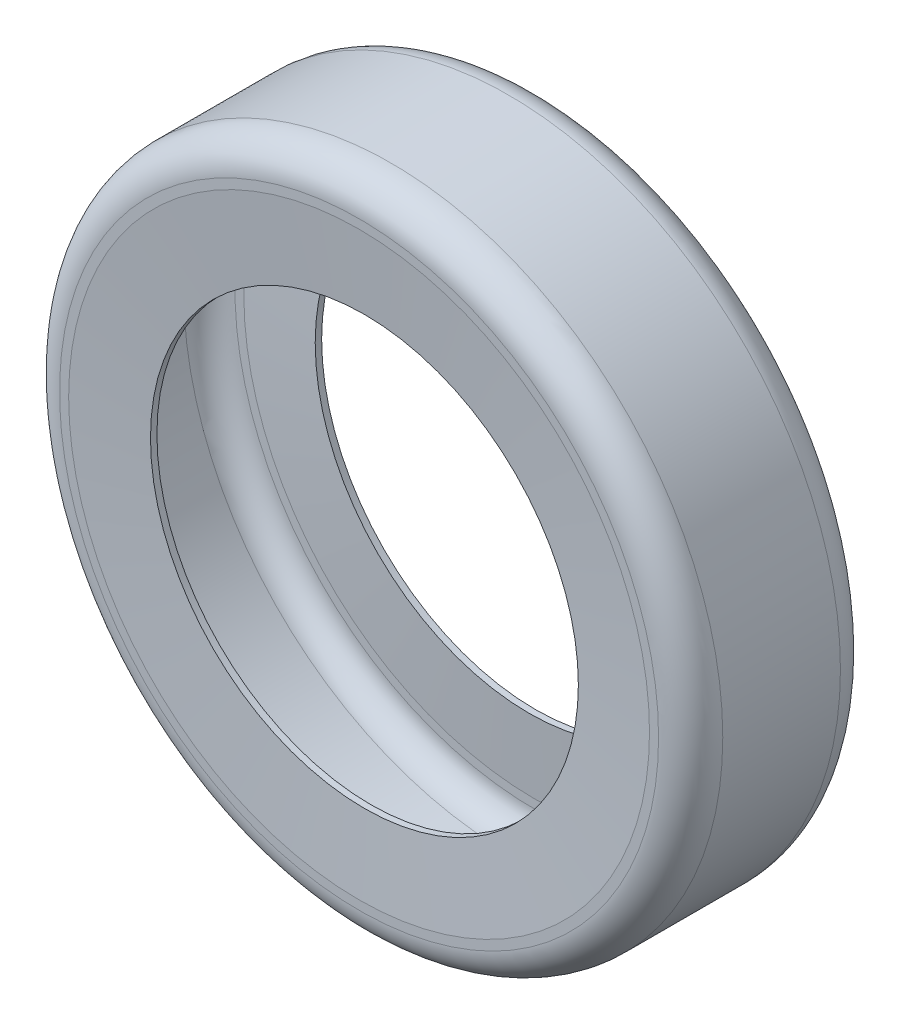
ISO-10303-21;
HEADER;
FILE_DESCRIPTION(('STEP AP214'),'2;1');
FILE_NAME('part.step','',(''),(''),'','','');
FILE_SCHEMA(('AUTOMOTIVE_DESIGN { 1 0 10303 214 1 1 1 1 }'));
ENDSEC;
DATA;
#1=APPLICATION_CONTEXT('core data for automotive mechanical design processes');
#2=APPLICATION_PROTOCOL_DEFINITION('international standard','automotive_design',2000,#1);
#3=PRODUCT_CONTEXT('',#1,'mechanical');
#4=PRODUCT('Part','Part','',(#3));
#5=PRODUCT_RELATED_PRODUCT_CATEGORY('part','',(#4));
#6=PRODUCT_DEFINITION_FORMATION('','',#4);
#7=PRODUCT_DEFINITION_CONTEXT('part definition',#1,'design');
#8=PRODUCT_DEFINITION('design','',#6,#7);
#9=PRODUCT_DEFINITION_SHAPE('','',#8);
#10=(LENGTH_UNIT() NAMED_UNIT(*) SI_UNIT(.MILLI.,.METRE.));
#11=(NAMED_UNIT(*) PLANE_ANGLE_UNIT() SI_UNIT($,.RADIAN.));
#12=(NAMED_UNIT(*) SI_UNIT($,.STERADIAN.) SOLID_ANGLE_UNIT());
#13=UNCERTAINTY_MEASURE_WITH_UNIT(LENGTH_MEASURE(1.E-05),#10,'distance_accuracy_value','');
#14=(GEOMETRIC_REPRESENTATION_CONTEXT(3) GLOBAL_UNCERTAINTY_ASSIGNED_CONTEXT((#13)) GLOBAL_UNIT_ASSIGNED_CONTEXT((#10,
#11,#12)) REPRESENTATION_CONTEXT('',''));
#15=CARTESIAN_POINT('',(0.,0.,0.));
#16=DIRECTION('',(0.,0.,1.));
#17=DIRECTION('',(1.,0.,0.));
#18=AXIS2_PLACEMENT_3D('',#15,#16,#17);
#19=CARTESIAN_POINT('',(0.,0.,85.));
#20=DIRECTION('',(0.,0.,-1.));
#21=DIRECTION('',(-1.,0.,0.));
#22=AXIS2_PLACEMENT_3D('',#19,#20,#21);
#23=CYLINDRICAL_SURFACE('',#22,100.);
#24=CARTESIAN_POINT('',(0.,0.,5.50732569424352));
#25=DIRECTION('',(0.,0.,-1.));
#26=DIRECTION('',(-1.,0.,0.));
#27=AXIS2_PLACEMENT_3D('',#24,#25,#26);
#28=CIRCLE('',#27,100.);
#29=CARTESIAN_POINT('',(-100.,0.,5.50732569424352));
#30=VERTEX_POINT('',#29);
#31=EDGE_CURVE('E75',#30,#30,#28,.T.);
#32=ORIENTED_EDGE('',*,*,#31,.F.);
#33=EDGE_LOOP('',(#32));
#34=FACE_BOUND('',#33,.T.);
#35=CARTESIAN_POINT('',(0.,0.,2.5));
#36=DIRECTION('',(0.,0.,1.));
#37=DIRECTION('',(1.,0.,0.));
#38=AXIS2_PLACEMENT_3D('',#35,#36,#37);
#39=CIRCLE('',#38,100.);
#40=CARTESIAN_POINT('',(100.,0.,2.5));
#41=VERTEX_POINT('',#40);
#42=EDGE_CURVE('E62',#41,#41,#39,.F.);
#43=ORIENTED_EDGE('',*,*,#42,.T.);
#44=EDGE_LOOP('',(#43));
#45=FACE_BOUND('',#44,.T.);
#46=ADVANCED_FACE('F42',(#34,#45),#23,.F.);
#47=CARTESIAN_POINT('',(0.,0.,85.));
#48=DIRECTION('',(0.,0.,1.));
#49=DIRECTION('',(1.,0.,0.));
#50=AXIS2_PLACEMENT_3D('',#47,#48,#49);
#51=PLANE('',#50);
#52=CARTESIAN_POINT('',(0.,0.,85.));
#53=DIRECTION('',(0.,0.,1.));
#54=DIRECTION('',(1.,0.,0.));
#55=AXIS2_PLACEMENT_3D('',#52,#53,#54);
#56=CIRCLE('',#55,140.);
#57=CARTESIAN_POINT('',(140.,0.,85.));
#58=VERTEX_POINT('',#57);
#59=EDGE_CURVE('E12',#58,#58,#56,.T.);
#60=ORIENTED_EDGE('',*,*,#59,.T.);
#61=EDGE_LOOP('',(#60));
#62=FACE_BOUND('',#61,.T.);
#63=CARTESIAN_POINT('',(0.,0.,85.));
#64=DIRECTION('',(0.,0.,1.));
#65=DIRECTION('',(1.,0.,0.));
#66=AXIS2_PLACEMENT_3D('',#63,#64,#65);
#67=CIRCLE('',#66,135.751665641779);
#68=CARTESIAN_POINT('',(135.751665641779,0.,85.));
#69=VERTEX_POINT('',#68);
#70=EDGE_CURVE('E68',#69,#69,#67,.F.);
#71=ORIENTED_EDGE('',*,*,#70,.T.);
#72=EDGE_LOOP('',(#71));
#73=FACE_BOUND('',#72,.T.);
#74=ADVANCED_FACE('F136',(#62,#73),#51,.T.);
#75=CARTESIAN_POINT('',(0.,0.,0.));
#76=DIRECTION('',(0.,0.,1.));
#77=DIRECTION('',(1.,0.,0.));
#78=AXIS2_PLACEMENT_3D('',#75,#76,#77);
#79=PLANE('',#78);
#80=CARTESIAN_POINT('',(0.,0.,0.));
#81=DIRECTION('',(0.,0.,1.));
#82=DIRECTION('',(1.,0.,0.));
#83=AXIS2_PLACEMENT_3D('',#80,#81,#82);
#84=CIRCLE('',#83,140.);
#85=CARTESIAN_POINT('',(140.,0.,0.));
#86=VERTEX_POINT('',#85);
#87=EDGE_CURVE('E57',#86,#86,#84,.F.);
#88=ORIENTED_EDGE('',*,*,#87,.T.);
#89=EDGE_LOOP('',(#88));
#90=FACE_BOUND('',#89,.T.);
#91=CARTESIAN_POINT('',(0.,0.,0.));
#92=DIRECTION('',(0.,0.,1.));
#93=DIRECTION('',(1.,0.,0.));
#94=AXIS2_PLACEMENT_3D('',#91,#92,#93);
#95=CIRCLE('',#94,135.751665641779);
#96=CARTESIAN_POINT('',(135.751665641779,0.,0.));
#97=VERTEX_POINT('',#96);
#98=EDGE_CURVE('E65',#97,#97,#95,.T.);
#99=ORIENTED_EDGE('',*,*,#98,.T.);
#100=EDGE_LOOP('',(#99));
#101=FACE_BOUND('',#100,.T.);
#102=ADVANCED_FACE('F119',(#90,#101),#79,.F.);
#103=CARTESIAN_POINT('',(0.,0.,79.4926743057565));
#104=DIRECTION('',(0.,0.,1.));
#105=DIRECTION('',(1.,0.,0.));
#106=AXIS2_PLACEMENT_3D('',#103,#104,#105);
#107=CIRCLE('',#106,100.);
#108=CARTESIAN_POINT('',(100.,0.,79.4926743057565));
#109=VERTEX_POINT('',#108);
#110=EDGE_CURVE('E80',#109,#109,#107,.T.);
#111=ORIENTED_EDGE('',*,*,#110,.F.);
#112=EDGE_LOOP('',(#111));
#113=FACE_BOUND('',#112,.T.);
#114=CARTESIAN_POINT('',(0.,0.,82.5));
#115=DIRECTION('',(0.,0.,1.));
#116=DIRECTION('',(1.,0.,0.));
#117=AXIS2_PLACEMENT_3D('',#114,#115,#116);
#118=CIRCLE('',#117,100.);
#119=CARTESIAN_POINT('',(100.,0.,82.5));
#120=VERTEX_POINT('',#119);
#121=EDGE_CURVE('E71',#120,#120,#118,.T.);
#122=ORIENTED_EDGE('',*,*,#121,.T.);
#123=EDGE_LOOP('',(#122));
#124=FACE_BOUND('',#123,.T.);
#125=ADVANCED_FACE('F115',(#113,#124),#23,.F.);
#126=CARTESIAN_POINT('',(0.,0.,82.5));
#127=DIRECTION('',(0.,0.,1.));
#128=DIRECTION('',(1.,0.,0.));
#129=AXIS2_PLACEMENT_3D('',#126,#127,#128);
#130=CONICAL_SURFACE('',#129,100.,1.50098315671512);
#131=ORIENTED_EDGE('',*,*,#70,.F.);
#132=EDGE_LOOP('',(#131));
#133=FACE_BOUND('',#132,.T.);
#134=ORIENTED_EDGE('',*,*,#121,.F.);
#135=EDGE_LOOP('',(#134));
#136=FACE_BOUND('',#135,.T.);
#137=ADVANCED_FACE('F118',(#133,#136),#130,.F.);
#138=CARTESIAN_POINT('',(0.,0.,0.));
#139=DIRECTION('',(0.,0.,-1.));
#140=DIRECTION('',(-1.,0.,0.));
#141=AXIS2_PLACEMENT_3D('',#138,#139,#140);
#142=CONICAL_SURFACE('',#141,135.751665641779,1.50098315671512);
#143=ORIENTED_EDGE('',*,*,#42,.F.);
#144=EDGE_LOOP('',(#143));
#145=FACE_BOUND('',#144,.T.);
#146=ORIENTED_EDGE('',*,*,#98,.F.);
#147=EDGE_LOOP('',(#146));
#148=FACE_BOUND('',#147,.T.);
#149=ADVANCED_FACE('F124',(#145,#148),#142,.F.);
#150=CARTESIAN_POINT('',(0.,0.,156.));
#151=DIRECTION('',(0.,0.,-1.));
#152=DIRECTION('',(-1.,0.,0.));
#153=AXIS2_PLACEMENT_3D('',#150,#151,#152);
#154=CYLINDRICAL_SURFACE('',#153,155.);
#155=CARTESIAN_POINT('',(0.,0.,15.));
#156=DIRECTION('',(0.,0.,1.));
#157=DIRECTION('',(1.,0.,0.));
#158=AXIS2_PLACEMENT_3D('',#155,#156,#157);
#159=CIRCLE('',#158,155.);
#160=CARTESIAN_POINT('',(155.,0.,15.));
#161=VERTEX_POINT('',#160);
#162=EDGE_CURVE('E49',#161,#161,#159,.T.);
#163=ORIENTED_EDGE('',*,*,#162,.T.);
#164=EDGE_LOOP('',(#163));
#165=FACE_BOUND('',#164,.T.);
#166=CARTESIAN_POINT('',(0.,0.,70.));
#167=DIRECTION('',(0.,0.,1.));
#168=DIRECTION('',(1.,0.,0.));
#169=AXIS2_PLACEMENT_3D('',#166,#167,#168);
#170=CIRCLE('',#169,155.);
#171=CARTESIAN_POINT('',(155.,0.,70.));
#172=VERTEX_POINT('',#171);
#173=EDGE_CURVE('E53',#172,#172,#170,.F.);
#174=ORIENTED_EDGE('',*,*,#173,.T.);
#175=EDGE_LOOP('',(#174));
#176=FACE_BOUND('',#175,.T.);
#177=ADVANCED_FACE('F130',(#165,#176),#154,.T.);
#178=CARTESIAN_POINT('',(0.,0.,15.));
#179=DIRECTION('',(0.,0.,1.));
#180=DIRECTION('',(1.,0.,0.));
#181=AXIS2_PLACEMENT_3D('',#178,#179,#180);
#182=TOROIDAL_SURFACE('',#181,140.,15.);
#183=ORIENTED_EDGE('',*,*,#162,.F.);
#184=EDGE_LOOP('',(#183));
#185=FACE_BOUND('',#184,.T.);
#186=ORIENTED_EDGE('',*,*,#87,.F.);
#187=EDGE_LOOP('',(#186));
#188=FACE_BOUND('',#187,.T.);
#189=ADVANCED_FACE('F155',(#185,#188),#182,.T.);
#190=CARTESIAN_POINT('',(0.,0.,70.));
#191=DIRECTION('',(0.,0.,1.));
#192=DIRECTION('',(1.,0.,0.));
#193=AXIS2_PLACEMENT_3D('',#190,#191,#192);
#194=TOROIDAL_SURFACE('',#193,140.,15.);
#195=ORIENTED_EDGE('',*,*,#173,.F.);
#196=EDGE_LOOP('',(#195));
#197=FACE_BOUND('',#196,.T.);
#198=ORIENTED_EDGE('',*,*,#59,.F.);
#199=EDGE_LOOP('',(#198));
#200=FACE_BOUND('',#199,.T.);
#201=ADVANCED_FACE('F44',(#197,#200),#194,.T.);
#202=CARTESIAN_POINT('',(0.,0.,82.));
#203=DIRECTION('',(0.,0.,1.));
#204=DIRECTION('',(1.,0.,0.));
#205=AXIS2_PLACEMENT_3D('',#202,#203,#204);
#206=PLANE('',#205);
#207=CARTESIAN_POINT('',(0.,0.,82.));
#208=DIRECTION('',(0.,0.,1.));
#209=DIRECTION('',(1.,0.,0.));
#210=AXIS2_PLACEMENT_3D('',#207,#208,#209);
#211=CIRCLE('',#210,140.);
#212=CARTESIAN_POINT('',(140.,0.,82.));
#213=VERTEX_POINT('',#212);
#214=EDGE_CURVE('E74',#213,#213,#211,.T.);
#215=ORIENTED_EDGE('',*,*,#214,.F.);
#216=EDGE_LOOP('',(#215));
#217=FACE_BOUND('',#216,.T.);
#218=CARTESIAN_POINT('',(0.,0.,82.));
#219=DIRECTION('',(0.,0.,1.));
#220=DIRECTION('',(1.,0.,0.));
#221=AXIS2_PLACEMENT_3D('',#218,#219,#220);
#222=CIRCLE('',#221,135.856427950254);
#223=CARTESIAN_POINT('',(135.856427950254,0.,82.));
#224=VERTEX_POINT('',#223);
#225=EDGE_CURVE('E83',#224,#224,#222,.F.);
#226=ORIENTED_EDGE('',*,*,#225,.F.);
#227=EDGE_LOOP('',(#226));
#228=FACE_BOUND('',#227,.T.);
#229=ADVANCED_FACE('F101',(#217,#228),#206,.F.);
#230=CARTESIAN_POINT('',(0.,0.,3.));
#231=DIRECTION('',(0.,0.,1.));
#232=DIRECTION('',(1.,0.,0.));
#233=AXIS2_PLACEMENT_3D('',#230,#231,#232);
#234=PLANE('',#233);
#235=CARTESIAN_POINT('',(0.,0.,3.00000000000001));
#236=DIRECTION('',(0.,0.,1.));
#237=DIRECTION('',(1.,0.,0.));
#238=AXIS2_PLACEMENT_3D('',#235,#236,#237);
#239=CIRCLE('',#238,140.);
#240=CARTESIAN_POINT('',(140.,0.,3.00000000000001));
#241=VERTEX_POINT('',#240);
#242=EDGE_CURVE('E78',#241,#241,#239,.F.);
#243=ORIENTED_EDGE('',*,*,#242,.F.);
#244=EDGE_LOOP('',(#243));
#245=FACE_BOUND('',#244,.T.);
#246=CARTESIAN_POINT('',(0.,0.,3.));
#247=DIRECTION('',(0.,0.,1.));
#248=DIRECTION('',(1.,0.,0.));
#249=AXIS2_PLACEMENT_3D('',#246,#247,#248);
#250=CIRCLE('',#249,135.856427950254);
#251=CARTESIAN_POINT('',(135.856427950254,0.,3.));
#252=VERTEX_POINT('',#251);
#253=EDGE_CURVE('E79',#252,#252,#250,.T.);
#254=ORIENTED_EDGE('',*,*,#253,.F.);
#255=EDGE_LOOP('',(#254));
#256=FACE_BOUND('',#255,.T.);
#257=ADVANCED_FACE('F104',(#245,#256),#234,.T.);
#258=CARTESIAN_POINT('',(0.,0.,79.5073078492205));
#259=DIRECTION('',(0.,0.,1.));
#260=DIRECTION('',(1.,0.,0.));
#261=AXIS2_PLACEMENT_3D('',#258,#259,#260);
#262=CONICAL_SURFACE('',#261,100.209269421232,1.50098315671512);
#263=ORIENTED_EDGE('',*,*,#225,.T.);
#264=EDGE_LOOP('',(#263));
#265=FACE_BOUND('',#264,.T.);
#266=ORIENTED_EDGE('',*,*,#110,.T.);
#267=EDGE_LOOP('',(#266));
#268=FACE_BOUND('',#267,.T.);
#269=ADVANCED_FACE('F108',(#265,#268),#262,.T.);
#270=CARTESIAN_POINT('',(0.,0.,2.99269215077947));
#271=DIRECTION('',(0.,0.,-1.));
#272=DIRECTION('',(-1.,0.,0.));
#273=AXIS2_PLACEMENT_3D('',#270,#271,#272);
#274=CONICAL_SURFACE('',#273,135.960935063011,1.50098315671512);
#275=ORIENTED_EDGE('',*,*,#31,.T.);
#276=EDGE_LOOP('',(#275));
#277=FACE_BOUND('',#276,.T.);
#278=ORIENTED_EDGE('',*,*,#253,.T.);
#279=EDGE_LOOP('',(#278));
#280=FACE_BOUND('',#279,.T.);
#281=ADVANCED_FACE('F111',(#277,#280),#274,.T.);
#282=CARTESIAN_POINT('',(0.,0.,156.));
#283=DIRECTION('',(0.,0.,-1.));
#284=DIRECTION('',(-1.,0.,0.));
#285=AXIS2_PLACEMENT_3D('',#282,#283,#284);
#286=CYLINDRICAL_SURFACE('',#285,152.);
#287=CARTESIAN_POINT('',(0.,0.,15.));
#288=DIRECTION('',(0.,0.,-1.));
#289=DIRECTION('',(-1.,0.,0.));
#290=AXIS2_PLACEMENT_3D('',#287,#288,#289);
#291=CIRCLE('',#290,152.);
#292=CARTESIAN_POINT('',(-152.,0.,15.));
#293=VERTEX_POINT('',#292);
#294=EDGE_CURVE('E89',#293,#293,#291,.F.);
#295=ORIENTED_EDGE('',*,*,#294,.F.);
#296=EDGE_LOOP('',(#295));
#297=FACE_BOUND('',#296,.T.);
#298=CARTESIAN_POINT('',(0.,0.,70.));
#299=DIRECTION('',(0.,0.,-1.));
#300=DIRECTION('',(-1.,0.,0.));
#301=AXIS2_PLACEMENT_3D('',#298,#299,#300);
#302=CIRCLE('',#301,152.);
#303=CARTESIAN_POINT('',(-152.,0.,70.));
#304=VERTEX_POINT('',#303);
#305=EDGE_CURVE('E88',#304,#304,#302,.T.);
#306=ORIENTED_EDGE('',*,*,#305,.F.);
#307=EDGE_LOOP('',(#306));
#308=FACE_BOUND('',#307,.T.);
#309=ADVANCED_FACE('F225',(#297,#308),#286,.F.);
#310=CARTESIAN_POINT('',(0.,0.,15.));
#311=DIRECTION('',(0.,0.,1.));
#312=DIRECTION('',(1.,0.,0.));
#313=AXIS2_PLACEMENT_3D('',#310,#311,#312);
#314=TOROIDAL_SURFACE('',#313,140.,12.);
#315=ORIENTED_EDGE('',*,*,#294,.T.);
#316=EDGE_LOOP('',(#315));
#317=FACE_BOUND('',#316,.T.);
#318=ORIENTED_EDGE('',*,*,#242,.T.);
#319=EDGE_LOOP('',(#318));
#320=FACE_BOUND('',#319,.T.);
#321=ADVANCED_FACE('F235',(#317,#320),#314,.F.);
#322=CARTESIAN_POINT('',(0.,0.,70.));
#323=DIRECTION('',(0.,0.,1.));
#324=DIRECTION('',(1.,0.,0.));
#325=AXIS2_PLACEMENT_3D('',#322,#323,#324);
#326=TOROIDAL_SURFACE('',#325,140.,12.);
#327=ORIENTED_EDGE('',*,*,#305,.T.);
#328=EDGE_LOOP('',(#327));
#329=FACE_BOUND('',#328,.T.);
#330=ORIENTED_EDGE('',*,*,#214,.T.);
#331=EDGE_LOOP('',(#330));
#332=FACE_BOUND('',#331,.T.);
#333=ADVANCED_FACE('F99',(#329,#332),#326,.F.);
#334=CLOSED_SHELL('',(#46,#74,#102,#125,#137,#149,#177,#189,#201,#229,#257,#269,#281,#309,#321,#333));
#335=MANIFOLD_SOLID_BREP('B2',#334);
#336=ADVANCED_BREP_SHAPE_REPRESENTATION('',(#18,#335),#14);
#337=SHAPE_DEFINITION_REPRESENTATION(#9,#336);
ENDSEC;
END-ISO-10303-21;
